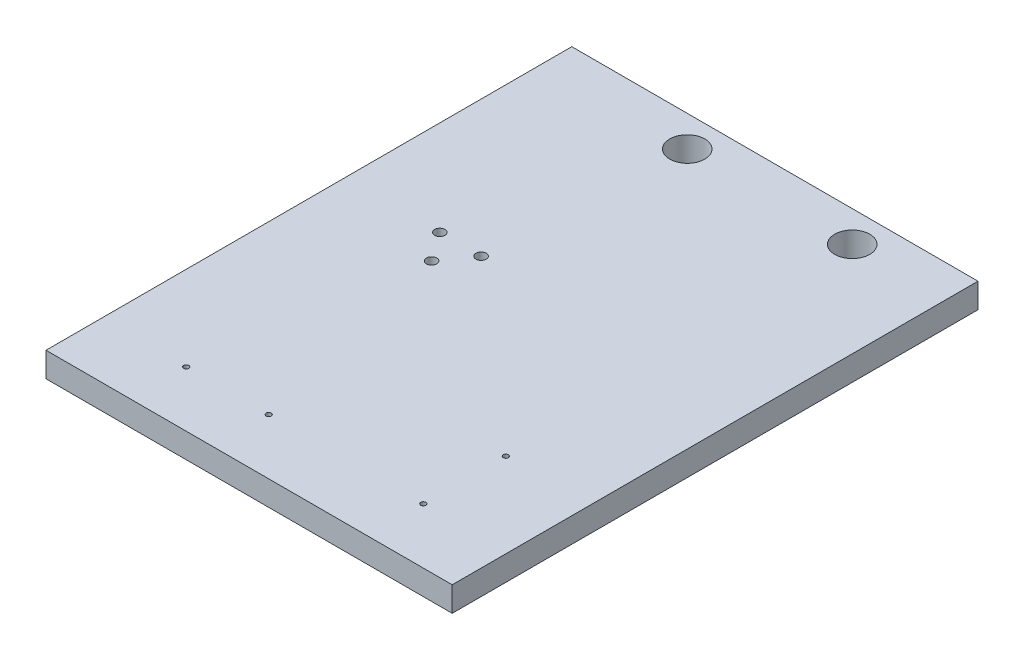
ISO-10303-21;
HEADER;
FILE_DESCRIPTION(('STEP AP214'),'2;1');
FILE_NAME('part.step','',(''),(''),'','','');
FILE_SCHEMA(('AUTOMOTIVE_DESIGN { 1 0 10303 214 1 1 1 1 }'));
ENDSEC;
DATA;
#1=APPLICATION_CONTEXT('core data for automotive mechanical design processes');
#2=APPLICATION_PROTOCOL_DEFINITION('international standard','automotive_design',2000,#1);
#3=PRODUCT_CONTEXT('',#1,'mechanical');
#4=PRODUCT('Part','Part','',(#3));
#5=PRODUCT_RELATED_PRODUCT_CATEGORY('part','',(#4));
#6=PRODUCT_DEFINITION_FORMATION('','',#4);
#7=PRODUCT_DEFINITION_CONTEXT('part definition',#1,'design');
#8=PRODUCT_DEFINITION('design','',#6,#7);
#9=PRODUCT_DEFINITION_SHAPE('','',#8);
#10=(LENGTH_UNIT() NAMED_UNIT(*) SI_UNIT(.MILLI.,.METRE.));
#11=(NAMED_UNIT(*) PLANE_ANGLE_UNIT() SI_UNIT($,.RADIAN.));
#12=(NAMED_UNIT(*) SI_UNIT($,.STERADIAN.) SOLID_ANGLE_UNIT());
#13=UNCERTAINTY_MEASURE_WITH_UNIT(LENGTH_MEASURE(1.E-05),#10,'distance_accuracy_value','');
#14=(GEOMETRIC_REPRESENTATION_CONTEXT(3) GLOBAL_UNCERTAINTY_ASSIGNED_CONTEXT((#13)) GLOBAL_UNIT_ASSIGNED_CONTEXT((#10,
#11,#12)) REPRESENTATION_CONTEXT('',''));
#15=CARTESIAN_POINT('',(0.,0.,0.));
#16=DIRECTION('',(0.,0.,1.));
#17=DIRECTION('',(1.,0.,0.));
#18=AXIS2_PLACEMENT_3D('',#15,#16,#17);
#19=CARTESIAN_POINT('',(57.5,5.99999999997181,100.5));
#20=DIRECTION('',(0.,1.,0.));
#21=DIRECTION('',(0.,0.,1.));
#22=AXIS2_PLACEMENT_3D('',#19,#20,#21);
#23=CONICAL_SURFACE('',#22,1.24999999995953,1.0297442586752);
#24=CARTESIAN_POINT('',(57.5,6.00000000000001,100.5));
#25=DIRECTION('',(0.,1.,0.));
#26=DIRECTION('',(0.,0.,1.));
#27=AXIS2_PLACEMENT_3D('',#24,#25,#26);
#28=CIRCLE('',#27,1.25);
#29=CARTESIAN_POINT('',(56.2500000000085,6.00000000000717,100.5));
#30=VERTEX_POINT('',#29);
#31=CARTESIAN_POINT('',(58.7499999999937,6.00000000000717,100.5));
#32=VERTEX_POINT('',#31);
#33=EDGE_CURVE('E127',#30,#32,#28,.T.);
#34=ORIENTED_EDGE('',*,*,#33,.T.);
#35=DIRECTION('',(-0.857167300703835,-0.515038074907187,0.));
#36=VECTOR('',#35,1.);
#37=CARTESIAN_POINT('',(498957.,299774.311324496,100.500000000031));
#38=LINE('',#37,#36);
#39=CARTESIAN_POINT('',(57.4999999999761,5.24892422626522,100.5));
#40=VERTEX_POINT('',#39);
#41=EDGE_CURVE('E120',#32,#40,#38,.T.);
#42=ORIENTED_EDGE('',*,*,#41,.T.);
#43=DIRECTION('',(0.857167300703835,-0.515038074907187,0.));
#44=VECTOR('',#43,1.);
#45=CARTESIAN_POINT('',(-498842.,299774.311324496,100.499999999908));
#46=LINE('',#45,#44);
#47=EDGE_CURVE('E117',#40,#30,#46,.F.);
#48=ORIENTED_EDGE('',*,*,#47,.T.);
#49=EDGE_LOOP('',(#34,#42,#48));
#50=FACE_BOUND('',#49,.T.);
#51=ADVANCED_FACE('F24',(#50),#23,.F.);
#52=CARTESIAN_POINT('',(57.5,6.00000000002865,100.5));
#53=DIRECTION('',(0.,1.,0.));
#54=DIRECTION('',(0.,0.,1.));
#55=AXIS2_PLACEMENT_3D('',#52,#53,#54);
#56=CONICAL_SURFACE('',#55,1.24999999998135,1.02974425866186);
#57=ORIENTED_EDGE('',*,*,#47,.F.);
#58=ORIENTED_EDGE('',*,*,#41,.F.);
#59=CARTESIAN_POINT('',(57.5,6.00000000000001,100.5));
#60=DIRECTION('',(0.,1.,0.));
#61=DIRECTION('',(0.,0.,1.));
#62=AXIS2_PLACEMENT_3D('',#59,#60,#61);
#63=CIRCLE('',#62,1.25);
#64=EDGE_CURVE('E123',#32,#30,#63,.T.);
#65=ORIENTED_EDGE('',*,*,#64,.T.);
#66=EDGE_LOOP('',(#57,#58,#65));
#67=FACE_BOUND('',#66,.T.);
#68=ADVANCED_FACE('F119',(#67),#56,.F.);
#69=CARTESIAN_POINT('',(-17.5,5.99999999997181,100.5));
#70=DIRECTION('',(0.,1.,0.));
#71=DIRECTION('',(0.,0.,1.));
#72=AXIS2_PLACEMENT_3D('',#69,#70,#71);
#73=CONICAL_SURFACE('',#72,1.24999999995953,1.0297442586752);
#74=CARTESIAN_POINT('',(-17.5,6.00000000000001,100.5));
#75=DIRECTION('',(0.,1.,0.));
#76=DIRECTION('',(0.,0.,1.));
#77=AXIS2_PLACEMENT_3D('',#74,#75,#76);
#78=CIRCLE('',#77,1.25);
#79=CARTESIAN_POINT('',(-18.7499999999887,6.00000000000717,100.5));
#80=VERTEX_POINT('',#79);
#81=CARTESIAN_POINT('',(-16.2500000000035,6.00000000000717,100.5));
#82=VERTEX_POINT('',#81);
#83=EDGE_CURVE('E254',#80,#82,#78,.T.);
#84=ORIENTED_EDGE('',*,*,#83,.T.);
#85=DIRECTION('',(-0.857167300703835,-0.515038074907187,0.));
#86=VECTOR('',#85,1.);
#87=CARTESIAN_POINT('',(498882.,299774.311324496,100.500000000031));
#88=LINE('',#87,#86);
#89=CARTESIAN_POINT('',(-17.5000000000125,5.24892422626522,100.5));
#90=VERTEX_POINT('',#89);
#91=EDGE_CURVE('E125',#82,#90,#88,.T.);
#92=ORIENTED_EDGE('',*,*,#91,.T.);
#93=DIRECTION('',(0.857167300703835,-0.515038074907187,0.));
#94=VECTOR('',#93,1.);
#95=CARTESIAN_POINT('',(-498917.,299774.311324496,100.499999999908));
#96=LINE('',#95,#94);
#97=EDGE_CURVE('E251',#90,#80,#96,.F.);
#98=ORIENTED_EDGE('',*,*,#97,.T.);
#99=EDGE_LOOP('',(#84,#92,#98));
#100=FACE_BOUND('',#99,.T.);
#101=ADVANCED_FACE('F277',(#100),#73,.F.);
#102=CARTESIAN_POINT('',(-17.5,6.00000000002865,100.5));
#103=DIRECTION('',(0.,1.,0.));
#104=DIRECTION('',(0.,0.,1.));
#105=AXIS2_PLACEMENT_3D('',#102,#103,#104);
#106=CONICAL_SURFACE('',#105,1.24999999998135,1.02974425866186);
#107=ORIENTED_EDGE('',*,*,#97,.F.);
#108=ORIENTED_EDGE('',*,*,#91,.F.);
#109=CARTESIAN_POINT('',(-17.5,6.00000000000001,100.5));
#110=DIRECTION('',(0.,1.,0.));
#111=DIRECTION('',(0.,0.,1.));
#112=AXIS2_PLACEMENT_3D('',#109,#110,#111);
#113=CIRCLE('',#112,1.25);
#114=EDGE_CURVE('E237',#82,#80,#113,.T.);
#115=ORIENTED_EDGE('',*,*,#114,.T.);
#116=EDGE_LOOP('',(#107,#108,#115));
#117=FACE_BOUND('',#116,.T.);
#118=ADVANCED_FACE('F280',(#117),#106,.F.);
#119=CARTESIAN_POINT('',(57.4999999999998,5.99999999991496,60.5));
#120=DIRECTION('',(0.,1.,0.));
#121=DIRECTION('',(-1.,0.,0.));
#122=AXIS2_PLACEMENT_3D('',#119,#120,#121);
#123=CONICAL_SURFACE('',#122,1.24999999975262,1.02974425843444);
#124=CARTESIAN_POINT('',(57.4999999999998,6.00000000000001,60.5));
#125=DIRECTION('',(0.,1.,0.));
#126=DIRECTION('',(0.,0.,1.));
#127=AXIS2_PLACEMENT_3D('',#124,#125,#126);
#128=CIRCLE('',#127,1.25);
#129=CARTESIAN_POINT('',(56.250000000051,5.99999999997874,60.5));
#130=VERTEX_POINT('',#129);
#131=CARTESIAN_POINT('',(58.7499999999225,5.99999999996453,60.5));
#132=VERTEX_POINT('',#131);
#133=EDGE_CURVE('E234',#130,#132,#128,.T.);
#134=ORIENTED_EDGE('',*,*,#133,.T.);
#135=DIRECTION('',(-0.857167300703836,-0.515038074907186,0.));
#136=VECTOR('',#135,1.);
#137=CARTESIAN_POINT('',(498997.,299798.345749255,60.5000000000306));
#138=LINE('',#137,#136);
#139=CARTESIAN_POINT('',(57.5000000002317,5.24892422615153,60.5));
#140=VERTEX_POINT('',#139);
#141=EDGE_CURVE('E246',#132,#140,#138,.T.);
#142=ORIENTED_EDGE('',*,*,#141,.T.);
#143=DIRECTION('',(0.857167300703836,-0.515038074907186,0.));
#144=VECTOR('',#143,1.);
#145=CARTESIAN_POINT('',(-498882.,299798.345749255,60.4999999999084));
#146=LINE('',#145,#144);
#147=EDGE_CURVE('E231',#140,#130,#146,.F.);
#148=ORIENTED_EDGE('',*,*,#147,.T.);
#149=EDGE_LOOP('',(#134,#142,#148));
#150=FACE_BOUND('',#149,.T.);
#151=ADVANCED_FACE('F422',(#150),#123,.F.);
#152=CARTESIAN_POINT('',(57.4999999999998,5.99999999991496,60.5));
#153=DIRECTION('',(0.,1.,0.));
#154=DIRECTION('',(-1.,0.,0.));
#155=AXIS2_PLACEMENT_3D('',#152,#153,#154);
#156=CONICAL_SURFACE('',#155,1.24999999979036,1.02974425838754);
#157=ORIENTED_EDGE('',*,*,#147,.F.);
#158=ORIENTED_EDGE('',*,*,#141,.F.);
#159=CARTESIAN_POINT('',(57.4999999999998,6.00000000000001,60.5));
#160=DIRECTION('',(0.,1.,0.));
#161=DIRECTION('',(0.,0.,1.));
#162=AXIS2_PLACEMENT_3D('',#159,#160,#161);
#163=CIRCLE('',#162,1.25);
#164=EDGE_CURVE('E217',#132,#130,#163,.T.);
#165=ORIENTED_EDGE('',*,*,#164,.T.);
#166=EDGE_LOOP('',(#157,#158,#165));
#167=FACE_BOUND('',#166,.T.);
#168=ADVANCED_FACE('F418',(#167),#156,.F.);
#169=CARTESIAN_POINT('',(-57.5,5.99999999997181,100.5));
#170=DIRECTION('',(0.,1.,0.));
#171=DIRECTION('',(0.,0.,1.));
#172=AXIS2_PLACEMENT_3D('',#169,#170,#171);
#173=CONICAL_SURFACE('',#172,1.24999999995953,1.0297442586752);
#174=CARTESIAN_POINT('',(-57.5,6.00000000000001,100.5));
#175=DIRECTION('',(0.,1.,0.));
#176=DIRECTION('',(0.,0.,1.));
#177=AXIS2_PLACEMENT_3D('',#174,#175,#176);
#178=CIRCLE('',#177,1.25);
#179=CARTESIAN_POINT('',(-58.7499999999937,6.00000000000717,100.5));
#180=VERTEX_POINT('',#179);
#181=CARTESIAN_POINT('',(-56.2500000000085,6.00000000000717,100.5));
#182=VERTEX_POINT('',#181);
#183=EDGE_CURVE('E214',#180,#182,#178,.T.);
#184=ORIENTED_EDGE('',*,*,#183,.T.);
#185=DIRECTION('',(-0.857167300703835,-0.515038074907187,0.));
#186=VECTOR('',#185,1.);
#187=CARTESIAN_POINT('',(498842.,299774.311324496,100.50000000003));
#188=LINE('',#187,#186);
#189=CARTESIAN_POINT('',(-57.5000000000329,5.24892422626522,100.5));
#190=VERTEX_POINT('',#189);
#191=EDGE_CURVE('E226',#182,#190,#188,.T.);
#192=ORIENTED_EDGE('',*,*,#191,.T.);
#193=DIRECTION('',(0.857167300703835,-0.515038074907187,0.));
#194=VECTOR('',#193,1.);
#195=CARTESIAN_POINT('',(-498957.,299774.311324496,100.499999999908));
#196=LINE('',#195,#194);
#197=EDGE_CURVE('E211',#190,#180,#196,.F.);
#198=ORIENTED_EDGE('',*,*,#197,.T.);
#199=EDGE_LOOP('',(#184,#192,#198));
#200=FACE_BOUND('',#199,.T.);
#201=ADVANCED_FACE('F414',(#200),#173,.F.);
#202=CARTESIAN_POINT('',(-57.5,6.00000000002865,100.5));
#203=DIRECTION('',(0.,1.,0.));
#204=DIRECTION('',(0.,0.,1.));
#205=AXIS2_PLACEMENT_3D('',#202,#203,#204);
#206=CONICAL_SURFACE('',#205,1.24999999998135,1.02974425866186);
#207=ORIENTED_EDGE('',*,*,#197,.F.);
#208=ORIENTED_EDGE('',*,*,#191,.F.);
#209=CARTESIAN_POINT('',(-57.5,6.00000000000001,100.5));
#210=DIRECTION('',(0.,1.,0.));
#211=DIRECTION('',(0.,0.,1.));
#212=AXIS2_PLACEMENT_3D('',#209,#210,#211);
#213=CIRCLE('',#212,1.25);
#214=EDGE_CURVE('E197',#182,#180,#213,.T.);
#215=ORIENTED_EDGE('',*,*,#214,.T.);
#216=EDGE_LOOP('',(#207,#208,#215));
#217=FACE_BOUND('',#216,.T.);
#218=ADVANCED_FACE('F410',(#217),#206,.F.);
#219=CARTESIAN_POINT('',(-32.5,7.00000000006185,-17.5));
#220=DIRECTION('',(0.,1.,0.));
#221=DIRECTION('',(0.,0.,1.));
#222=AXIS2_PLACEMENT_3D('',#219,#220,#221);
#223=CONICAL_SURFACE('',#222,2.5000000000955,1.02974425867857);
#224=CARTESIAN_POINT('',(-32.5,7.00000000000001,-17.5));
#225=DIRECTION('',(0.,1.,0.));
#226=DIRECTION('',(0.,0.,1.));
#227=AXIS2_PLACEMENT_3D('',#224,#225,#226);
#228=CIRCLE('',#227,2.5);
#229=CARTESIAN_POINT('',(-35.0000000000062,7.00000000001544,-17.5));
#230=VERTEX_POINT('',#229);
#231=CARTESIAN_POINT('',(-29.9999999999932,7.00000000001544,-17.5));
#232=VERTEX_POINT('',#231);
#233=EDGE_CURVE('E194',#230,#232,#228,.T.);
#234=ORIENTED_EDGE('',*,*,#233,.T.);
#235=DIRECTION('',(-0.857167300703835,-0.515038074907187,0.));
#236=VECTOR('',#235,1.);
#237=CARTESIAN_POINT('',(498985.,299845.461801766,-17.4999999999695));
#238=LINE('',#237,#236);
#239=CARTESIAN_POINT('',(-32.5000000000557,5.49784845250656,-17.5));
#240=VERTEX_POINT('',#239);
#241=EDGE_CURVE('E206',#232,#240,#238,.T.);
#242=ORIENTED_EDGE('',*,*,#241,.T.);
#243=DIRECTION('',(0.857167300703835,-0.515038074907187,0.));
#244=VECTOR('',#243,1.);
#245=CARTESIAN_POINT('',(-499050.,299845.461801766,-17.5000000000917));
#246=LINE('',#245,#244);
#247=EDGE_CURVE('E191',#240,#230,#246,.F.);
#248=ORIENTED_EDGE('',*,*,#247,.T.);
#249=EDGE_LOOP('',(#234,#242,#248));
#250=FACE_BOUND('',#249,.T.);
#251=ADVANCED_FACE('F406',(#250),#223,.F.);
#252=CARTESIAN_POINT('',(-32.5,7.00000000017553,-17.5));
#253=DIRECTION('',(0.,1.,0.));
#254=DIRECTION('',(0.,0.,1.));
#255=AXIS2_PLACEMENT_3D('',#252,#253,#254);
#256=CONICAL_SURFACE('',#255,2.50000000018417,1.02974425866419);
#257=ORIENTED_EDGE('',*,*,#247,.F.);
#258=ORIENTED_EDGE('',*,*,#241,.F.);
#259=CARTESIAN_POINT('',(-32.5,7.00000000000001,-17.5));
#260=DIRECTION('',(0.,1.,0.));
#261=DIRECTION('',(0.,0.,1.));
#262=AXIS2_PLACEMENT_3D('',#259,#260,#261);
#263=CIRCLE('',#262,2.5);
#264=EDGE_CURVE('E176',#232,#230,#263,.T.);
#265=ORIENTED_EDGE('',*,*,#264,.T.);
#266=EDGE_LOOP('',(#257,#258,#265));
#267=FACE_BOUND('',#266,.T.);
#268=ADVANCED_FACE('F402',(#267),#256,.F.);
#269=CARTESIAN_POINT('',(-52.5,7.00000000006185,-17.5));
#270=DIRECTION('',(0.,1.,0.));
#271=DIRECTION('',(0.,0.,1.));
#272=AXIS2_PLACEMENT_3D('',#269,#270,#271);
#273=CONICAL_SURFACE('',#272,2.5000000000955,1.02974425867857);
#274=CARTESIAN_POINT('',(-52.5,7.00000000000001,-17.5));
#275=DIRECTION('',(0.,1.,0.));
#276=DIRECTION('',(0.,0.,1.));
#277=AXIS2_PLACEMENT_3D('',#274,#275,#276);
#278=CIRCLE('',#277,2.5);
#279=CARTESIAN_POINT('',(-55.0000000000017,7.00000000001544,-17.5));
#280=VERTEX_POINT('',#279);
#281=CARTESIAN_POINT('',(-50.0000000000028,7.00000000001544,-17.5));
#282=VERTEX_POINT('',#281);
#283=EDGE_CURVE('E171',#280,#282,#278,.T.);
#284=ORIENTED_EDGE('',*,*,#283,.T.);
#285=DIRECTION('',(-0.857167300703835,-0.515038074907187,0.));
#286=VECTOR('',#285,1.);
#287=CARTESIAN_POINT('',(498965.,299845.461801766,-17.4999999999694));
#288=LINE('',#287,#286);
#289=CARTESIAN_POINT('',(-52.5000000000659,5.49784845250656,-17.5));
#290=VERTEX_POINT('',#289);
#291=EDGE_CURVE('E186',#282,#290,#288,.T.);
#292=ORIENTED_EDGE('',*,*,#291,.T.);
#293=DIRECTION('',(0.857167300703835,-0.515038074907187,0.));
#294=VECTOR('',#293,1.);
#295=CARTESIAN_POINT('',(-499070.,299845.461801766,-17.5000000000917));
#296=LINE('',#295,#294);
#297=EDGE_CURVE('E183',#290,#280,#296,.F.);
#298=ORIENTED_EDGE('',*,*,#297,.T.);
#299=EDGE_LOOP('',(#284,#292,#298));
#300=FACE_BOUND('',#299,.T.);
#301=ADVANCED_FACE('F399',(#300),#273,.F.);
#302=CARTESIAN_POINT('',(-52.5,7.00000000006185,-17.5));
#303=DIRECTION('',(0.,1.,0.));
#304=DIRECTION('',(0.,0.,1.));
#305=AXIS2_PLACEMENT_3D('',#302,#303,#304);
#306=CONICAL_SURFACE('',#305,2.50000000001364,1.02974425866749);
#307=ORIENTED_EDGE('',*,*,#297,.F.);
#308=ORIENTED_EDGE('',*,*,#291,.F.);
#309=CARTESIAN_POINT('',(-52.5,7.00000000000001,-17.5));
#310=DIRECTION('',(0.,1.,0.));
#311=DIRECTION('',(0.,0.,1.));
#312=AXIS2_PLACEMENT_3D('',#309,#310,#311);
#313=CIRCLE('',#312,2.5);
#314=EDGE_CURVE('E167',#282,#280,#313,.T.);
#315=ORIENTED_EDGE('',*,*,#314,.T.);
#316=EDGE_LOOP('',(#307,#308,#315));
#317=FACE_BOUND('',#316,.T.);
#318=ADVANCED_FACE('F396',(#317),#306,.F.);
#319=CARTESIAN_POINT('',(-42.5,7.00000000000001,-3.5));
#320=DIRECTION('',(0.,-1.,0.));
#321=DIRECTION('',(0.,0.,-1.));
#322=AXIS2_PLACEMENT_3D('',#319,#320,#321);
#323=PLANE('',#322);
#324=CARTESIAN_POINT('',(-42.5,7.00000000000001,-3.5));
#325=DIRECTION('',(0.,-1.,0.));
#326=DIRECTION('',(0.,0.,-1.));
#327=AXIS2_PLACEMENT_3D('',#324,#325,#326);
#328=CIRCLE('',#327,2.5);
#329=CARTESIAN_POINT('',(-42.5,7.00000000000001,-6.));
#330=VERTEX_POINT('',#329);
#331=EDGE_CURVE('E27',#330,#330,#328,.F.);
#332=ORIENTED_EDGE('',*,*,#331,.T.);
#333=EDGE_LOOP('',(#332));
#334=FACE_BOUND('',#333,.T.);
#335=ADVANCED_FACE('F392',(#334),#323,.F.);
#336=CARTESIAN_POINT('',(57.5,4.91137043752998,100.5));
#337=DIRECTION('',(0.,1.,0.));
#338=DIRECTION('',(0.,0.,1.));
#339=AXIS2_PLACEMENT_3D('',#336,#337,#338);
#340=CYLINDRICAL_SURFACE('',#339,1.25);
#341=ORIENTED_EDGE('',*,*,#64,.F.);
#342=ORIENTED_EDGE('',*,*,#33,.F.);
#343=EDGE_LOOP('',(#341,#342));
#344=FACE_BOUND('',#343,.T.);
#345=CARTESIAN_POINT('',(57.5,12.,100.5));
#346=DIRECTION('',(0.,1.,0.));
#347=DIRECTION('',(0.,0.,1.));
#348=AXIS2_PLACEMENT_3D('',#345,#346,#347);
#349=CIRCLE('',#348,1.25);
#350=CARTESIAN_POINT('',(57.5,12.,101.75));
#351=VERTEX_POINT('',#350);
#352=EDGE_CURVE('E162',#351,#351,#349,.F.);
#353=ORIENTED_EDGE('',*,*,#352,.F.);
#354=EDGE_LOOP('',(#353));
#355=FACE_BOUND('',#354,.T.);
#356=ADVANCED_FACE('F286',(#344,#355),#340,.F.);
#357=CARTESIAN_POINT('',(-17.5,4.91137043752998,100.5));
#358=DIRECTION('',(0.,1.,0.));
#359=DIRECTION('',(0.,0.,1.));
#360=AXIS2_PLACEMENT_3D('',#357,#358,#359);
#361=CYLINDRICAL_SURFACE('',#360,1.25);
#362=ORIENTED_EDGE('',*,*,#114,.F.);
#363=ORIENTED_EDGE('',*,*,#83,.F.);
#364=EDGE_LOOP('',(#362,#363));
#365=FACE_BOUND('',#364,.T.);
#366=CARTESIAN_POINT('',(-17.5,12.,100.5));
#367=DIRECTION('',(0.,1.,0.));
#368=DIRECTION('',(0.,0.,1.));
#369=AXIS2_PLACEMENT_3D('',#366,#367,#368);
#370=CIRCLE('',#369,1.25);
#371=CARTESIAN_POINT('',(-17.5,12.,101.75));
#372=VERTEX_POINT('',#371);
#373=EDGE_CURVE('E160',#372,#372,#370,.F.);
#374=ORIENTED_EDGE('',*,*,#373,.F.);
#375=EDGE_LOOP('',(#374));
#376=FACE_BOUND('',#375,.T.);
#377=ADVANCED_FACE('F282',(#365,#376),#361,.F.);
#378=CARTESIAN_POINT('',(57.4999999999998,4.91137043752998,60.5));
#379=DIRECTION('',(0.,1.,0.));
#380=DIRECTION('',(0.,0.,1.));
#381=AXIS2_PLACEMENT_3D('',#378,#379,#380);
#382=CYLINDRICAL_SURFACE('',#381,1.25);
#383=ORIENTED_EDGE('',*,*,#164,.F.);
#384=ORIENTED_EDGE('',*,*,#133,.F.);
#385=EDGE_LOOP('',(#383,#384));
#386=FACE_BOUND('',#385,.T.);
#387=CARTESIAN_POINT('',(57.4999999999998,12.,60.5));
#388=DIRECTION('',(0.,1.,0.));
#389=DIRECTION('',(0.,0.,1.));
#390=AXIS2_PLACEMENT_3D('',#387,#388,#389);
#391=CIRCLE('',#390,1.25);
#392=CARTESIAN_POINT('',(57.4999999999998,12.,61.75));
#393=VERTEX_POINT('',#392);
#394=EDGE_CURVE('E157',#393,#393,#391,.F.);
#395=ORIENTED_EDGE('',*,*,#394,.F.);
#396=EDGE_LOOP('',(#395));
#397=FACE_BOUND('',#396,.T.);
#398=ADVANCED_FACE('F285',(#386,#397),#382,.F.);
#399=CARTESIAN_POINT('',(-57.5,4.91137043752998,100.5));
#400=DIRECTION('',(0.,1.,0.));
#401=DIRECTION('',(0.,0.,1.));
#402=AXIS2_PLACEMENT_3D('',#399,#400,#401);
#403=CYLINDRICAL_SURFACE('',#402,1.25);
#404=ORIENTED_EDGE('',*,*,#214,.F.);
#405=ORIENTED_EDGE('',*,*,#183,.F.);
#406=EDGE_LOOP('',(#404,#405));
#407=FACE_BOUND('',#406,.T.);
#408=CARTESIAN_POINT('',(-57.5,12.,100.5));
#409=DIRECTION('',(0.,1.,0.));
#410=DIRECTION('',(0.,0.,1.));
#411=AXIS2_PLACEMENT_3D('',#408,#409,#410);
#412=CIRCLE('',#411,1.25);
#413=CARTESIAN_POINT('',(-57.5,12.,101.75));
#414=VERTEX_POINT('',#413);
#415=EDGE_CURVE('E154',#414,#414,#412,.F.);
#416=ORIENTED_EDGE('',*,*,#415,.F.);
#417=EDGE_LOOP('',(#416));
#418=FACE_BOUND('',#417,.T.);
#419=ADVANCED_FACE('F378',(#407,#418),#403,.F.);
#420=CARTESIAN_POINT('',(-32.5,4.92274087505001,-17.5));
#421=DIRECTION('',(0.,1.,0.));
#422=DIRECTION('',(0.,0.,1.));
#423=AXIS2_PLACEMENT_3D('',#420,#421,#422);
#424=CYLINDRICAL_SURFACE('',#423,2.5);
#425=ORIENTED_EDGE('',*,*,#264,.F.);
#426=ORIENTED_EDGE('',*,*,#233,.F.);
#427=EDGE_LOOP('',(#425,#426));
#428=FACE_BOUND('',#427,.T.);
#429=CARTESIAN_POINT('',(-32.5,12.,-17.5));
#430=DIRECTION('',(0.,1.,0.));
#431=DIRECTION('',(0.,0.,1.));
#432=AXIS2_PLACEMENT_3D('',#429,#430,#431);
#433=CIRCLE('',#432,2.5);
#434=CARTESIAN_POINT('',(-32.5,12.,-15.));
#435=VERTEX_POINT('',#434);
#436=EDGE_CURVE('E151',#435,#435,#433,.F.);
#437=ORIENTED_EDGE('',*,*,#436,.F.);
#438=EDGE_LOOP('',(#437));
#439=FACE_BOUND('',#438,.T.);
#440=ADVANCED_FACE('F384',(#428,#439),#424,.F.);
#441=CARTESIAN_POINT('',(-52.5,4.92274087505001,-17.5));
#442=DIRECTION('',(0.,1.,0.));
#443=DIRECTION('',(0.,0.,1.));
#444=AXIS2_PLACEMENT_3D('',#441,#442,#443);
#445=CYLINDRICAL_SURFACE('',#444,2.5);
#446=ORIENTED_EDGE('',*,*,#314,.F.);
#447=ORIENTED_EDGE('',*,*,#283,.F.);
#448=EDGE_LOOP('',(#446,#447));
#449=FACE_BOUND('',#448,.T.);
#450=CARTESIAN_POINT('',(-52.5,12.,-17.5));
#451=DIRECTION('',(0.,1.,0.));
#452=DIRECTION('',(0.,0.,1.));
#453=AXIS2_PLACEMENT_3D('',#450,#451,#452);
#454=CIRCLE('',#453,2.5);
#455=CARTESIAN_POINT('',(-52.5,12.,-15.));
#456=VERTEX_POINT('',#455);
#457=EDGE_CURVE('E148',#456,#456,#454,.F.);
#458=ORIENTED_EDGE('',*,*,#457,.F.);
#459=EDGE_LOOP('',(#458));
#460=FACE_BOUND('',#459,.T.);
#461=ADVANCED_FACE('F512',(#449,#460),#445,.F.);
#462=CARTESIAN_POINT('',(-42.5,27.,-3.5));
#463=DIRECTION('',(0.,-1.,0.));
#464=DIRECTION('',(0.,0.,-1.));
#465=AXIS2_PLACEMENT_3D('',#462,#463,#464);
#466=CYLINDRICAL_SURFACE('',#465,2.5);
#467=ORIENTED_EDGE('',*,*,#331,.F.);
#468=EDGE_LOOP('',(#467));
#469=FACE_BOUND('',#468,.T.);
#470=CARTESIAN_POINT('',(-42.5,12.,-3.5));
#471=DIRECTION('',(0.,-1.,0.));
#472=DIRECTION('',(0.,0.,-1.));
#473=AXIS2_PLACEMENT_3D('',#470,#471,#472);
#474=CIRCLE('',#473,2.5);
#475=CARTESIAN_POINT('',(-42.5,12.,-6.));
#476=VERTEX_POINT('',#475);
#477=EDGE_CURVE('E144',#476,#476,#474,.T.);
#478=ORIENTED_EDGE('',*,*,#477,.F.);
#479=EDGE_LOOP('',(#478));
#480=FACE_BOUND('',#479,.T.);
#481=ADVANCED_FACE('F293',(#469,#480),#466,.F.);
#482=CARTESIAN_POINT('',(0.,12.,0.));
#483=DIRECTION('',(0.,1.,0.));
#484=DIRECTION('',(0.,0.,1.));
#485=AXIS2_PLACEMENT_3D('',#482,#483,#484);
#486=PLANE('',#485);
#487=ORIENTED_EDGE('',*,*,#477,.T.);
#488=EDGE_LOOP('',(#487));
#489=FACE_BOUND('',#488,.T.);
#490=CARTESIAN_POINT('',(52.4999999999998,12.,-112.5));
#491=DIRECTION('',(0.,1.,0.));
#492=DIRECTION('',(0.,0.,1.));
#493=AXIS2_PLACEMENT_3D('',#490,#491,#492);
#494=CIRCLE('',#493,8.5);
#495=CARTESIAN_POINT('',(52.4999999999998,12.,-104.));
#496=VERTEX_POINT('',#495);
#497=EDGE_CURVE('E137',#496,#496,#494,.F.);
#498=ORIENTED_EDGE('',*,*,#497,.T.);
#499=EDGE_LOOP('',(#498));
#500=FACE_BOUND('',#499,.T.);
#501=CARTESIAN_POINT('',(-27.5,12.,-112.5));
#502=DIRECTION('',(0.,-1.,0.));
#503=DIRECTION('',(0.,0.,-1.));
#504=AXIS2_PLACEMENT_3D('',#501,#502,#503);
#505=CIRCLE('',#504,8.5);
#506=CARTESIAN_POINT('',(-27.5,12.,-121.));
#507=VERTEX_POINT('',#506);
#508=EDGE_CURVE('E141',#507,#507,#505,.T.);
#509=ORIENTED_EDGE('',*,*,#508,.T.);
#510=EDGE_LOOP('',(#509));
#511=FACE_BOUND('',#510,.T.);
#512=ORIENTED_EDGE('',*,*,#457,.T.);
#513=EDGE_LOOP('',(#512));
#514=FACE_BOUND('',#513,.T.);
#515=ORIENTED_EDGE('',*,*,#436,.T.);
#516=EDGE_LOOP('',(#515));
#517=FACE_BOUND('',#516,.T.);
#518=ORIENTED_EDGE('',*,*,#415,.T.);
#519=EDGE_LOOP('',(#518));
#520=FACE_BOUND('',#519,.T.);
#521=ORIENTED_EDGE('',*,*,#394,.T.);
#522=EDGE_LOOP('',(#521));
#523=FACE_BOUND('',#522,.T.);
#524=ORIENTED_EDGE('',*,*,#373,.T.);
#525=EDGE_LOOP('',(#524));
#526=FACE_BOUND('',#525,.T.);
#527=ORIENTED_EDGE('',*,*,#352,.T.);
#528=EDGE_LOOP('',(#527));
#529=FACE_BOUND('',#528,.T.);
#530=DIRECTION('',(-1.,0.,0.));
#531=VECTOR('',#530,1.);
#532=CARTESIAN_POINT('',(98.4999999999996,12.,-127.5));
#533=LINE('',#532,#531);
#534=CARTESIAN_POINT('',(-98.5000000000001,12.,-127.5));
#535=VERTEX_POINT('',#534);
#536=CARTESIAN_POINT('',(98.4999999999996,12.,-127.5));
#537=VERTEX_POINT('',#536);
#538=EDGE_CURVE('E300',#535,#537,#533,.F.);
#539=ORIENTED_EDGE('',*,*,#538,.F.);
#540=DIRECTION('',(0.,0.,1.));
#541=VECTOR('',#540,1.);
#542=CARTESIAN_POINT('',(-98.5000000000001,12.,-127.5));
#543=LINE('',#542,#541);
#544=CARTESIAN_POINT('',(-98.5,12.,127.5));
#545=VERTEX_POINT('',#544);
#546=EDGE_CURVE('E147',#545,#535,#543,.F.);
#547=ORIENTED_EDGE('',*,*,#546,.F.);
#548=DIRECTION('',(1.,0.,0.));
#549=VECTOR('',#548,1.);
#550=CARTESIAN_POINT('',(-98.5,12.,127.5));
#551=LINE('',#550,#549);
#552=CARTESIAN_POINT('',(98.5,12.,127.5));
#553=VERTEX_POINT('',#552);
#554=EDGE_CURVE('E316',#553,#545,#551,.F.);
#555=ORIENTED_EDGE('',*,*,#554,.F.);
#556=DIRECTION('',(0.,0.,-1.));
#557=VECTOR('',#556,1.);
#558=CARTESIAN_POINT('',(98.5,12.,127.5));
#559=LINE('',#558,#557);
#560=EDGE_CURVE('E303',#537,#553,#559,.F.);
#561=ORIENTED_EDGE('',*,*,#560,.F.);
#562=EDGE_LOOP('',(#539,#547,#555,#561));
#563=FACE_BOUND('',#562,.T.);
#564=ADVANCED_FACE('F290',(#489,#500,#511,#514,#517,#520,#523,#526,#529,#563),#486,.T.);
#565=CARTESIAN_POINT('',(-98.5000000000001,0.,-127.5));
#566=DIRECTION('',(-1.,0.,0.));
#567=DIRECTION('',(0.,0.,1.));
#568=AXIS2_PLACEMENT_3D('',#565,#566,#567);
#569=PLANE('',#568);
#570=DIRECTION('',(0.,1.,0.));
#571=VECTOR('',#570,1.);
#572=CARTESIAN_POINT('',(-98.5000000000001,0.,-127.5));
#573=LINE('',#572,#571);
#574=CARTESIAN_POINT('',(-98.5000000000001,0.,-127.5));
#575=VERTEX_POINT('',#574);
#576=EDGE_CURVE('E305',#575,#535,#573,.T.);
#577=ORIENTED_EDGE('',*,*,#576,.F.);
#578=DIRECTION('',(0.,0.,1.));
#579=VECTOR('',#578,1.);
#580=CARTESIAN_POINT('',(-98.5,0.,0.));
#581=LINE('',#580,#579);
#582=CARTESIAN_POINT('',(-98.5,0.,127.5));
#583=VERTEX_POINT('',#582);
#584=EDGE_CURVE('E140',#575,#583,#581,.T.);
#585=ORIENTED_EDGE('',*,*,#584,.T.);
#586=DIRECTION('',(0.,1.,0.));
#587=VECTOR('',#586,1.);
#588=CARTESIAN_POINT('',(-98.5,0.,127.5));
#589=LINE('',#588,#587);
#590=EDGE_CURVE('E314',#545,#583,#589,.F.);
#591=ORIENTED_EDGE('',*,*,#590,.F.);
#592=ORIENTED_EDGE('',*,*,#546,.T.);
#593=EDGE_LOOP('',(#577,#585,#591,#592));
#594=FACE_BOUND('',#593,.T.);
#595=ADVANCED_FACE('F292',(#594),#569,.T.);
#596=CARTESIAN_POINT('',(-98.5,0.,127.5));
#597=DIRECTION('',(0.,0.,1.));
#598=DIRECTION('',(1.,0.,0.));
#599=AXIS2_PLACEMENT_3D('',#596,#597,#598);
#600=PLANE('',#599);
#601=ORIENTED_EDGE('',*,*,#590,.T.);
#602=DIRECTION('',(1.,0.,0.));
#603=VECTOR('',#602,1.);
#604=CARTESIAN_POINT('',(0.,0.,127.5));
#605=LINE('',#604,#603);
#606=CARTESIAN_POINT('',(98.5,0.,127.5));
#607=VERTEX_POINT('',#606);
#608=EDGE_CURVE('E327',#583,#607,#605,.T.);
#609=ORIENTED_EDGE('',*,*,#608,.T.);
#610=DIRECTION('',(0.,1.,0.));
#611=VECTOR('',#610,1.);
#612=CARTESIAN_POINT('',(98.5,0.,127.5));
#613=LINE('',#612,#611);
#614=EDGE_CURVE('E308',#553,#607,#613,.F.);
#615=ORIENTED_EDGE('',*,*,#614,.F.);
#616=ORIENTED_EDGE('',*,*,#554,.T.);
#617=EDGE_LOOP('',(#601,#609,#615,#616));
#618=FACE_BOUND('',#617,.T.);
#619=ADVANCED_FACE('F335',(#618),#600,.T.);
#620=CARTESIAN_POINT('',(98.5,0.,127.5));
#621=DIRECTION('',(1.,0.,0.));
#622=DIRECTION('',(0.,0.,-1.));
#623=AXIS2_PLACEMENT_3D('',#620,#621,#622);
#624=PLANE('',#623);
#625=ORIENTED_EDGE('',*,*,#614,.T.);
#626=DIRECTION('',(0.,0.,1.));
#627=VECTOR('',#626,1.);
#628=CARTESIAN_POINT('',(98.5,0.,0.));
#629=LINE('',#628,#627);
#630=CARTESIAN_POINT('',(98.4999999999996,0.,-127.5));
#631=VERTEX_POINT('',#630);
#632=EDGE_CURVE('E325',#607,#631,#629,.F.);
#633=ORIENTED_EDGE('',*,*,#632,.T.);
#634=DIRECTION('',(0.,1.,0.));
#635=VECTOR('',#634,1.);
#636=CARTESIAN_POINT('',(98.4999999999996,0.,-127.5));
#637=LINE('',#636,#635);
#638=EDGE_CURVE('E42',#537,#631,#637,.F.);
#639=ORIENTED_EDGE('',*,*,#638,.F.);
#640=ORIENTED_EDGE('',*,*,#560,.T.);
#641=EDGE_LOOP('',(#625,#633,#639,#640));
#642=FACE_BOUND('',#641,.T.);
#643=ADVANCED_FACE('F337',(#642),#624,.T.);
#644=CARTESIAN_POINT('',(98.4999999999996,0.,-127.5));
#645=DIRECTION('',(0.,0.,-1.));
#646=DIRECTION('',(-1.,0.,0.));
#647=AXIS2_PLACEMENT_3D('',#644,#645,#646);
#648=PLANE('',#647);
#649=ORIENTED_EDGE('',*,*,#638,.T.);
#650=DIRECTION('',(1.,0.,0.));
#651=VECTOR('',#650,1.);
#652=CARTESIAN_POINT('',(-3.88578058618805E-13,0.,-127.5));
#653=LINE('',#652,#651);
#654=EDGE_CURVE('E136',#631,#575,#653,.F.);
#655=ORIENTED_EDGE('',*,*,#654,.T.);
#656=ORIENTED_EDGE('',*,*,#576,.T.);
#657=ORIENTED_EDGE('',*,*,#538,.T.);
#658=EDGE_LOOP('',(#649,#655,#656,#657));
#659=FACE_BOUND('',#658,.T.);
#660=ADVANCED_FACE('F321',(#659),#648,.T.);
#661=CARTESIAN_POINT('',(-27.5,12.,-112.5));
#662=DIRECTION('',(0.,-1.,0.));
#663=DIRECTION('',(0.,0.,-1.));
#664=AXIS2_PLACEMENT_3D('',#661,#662,#663);
#665=CYLINDRICAL_SURFACE('',#664,8.5);
#666=ORIENTED_EDGE('',*,*,#508,.F.);
#667=EDGE_LOOP('',(#666));
#668=FACE_BOUND('',#667,.T.);
#669=CARTESIAN_POINT('',(-27.5,0.,-112.5));
#670=DIRECTION('',(0.,-1.,0.));
#671=DIRECTION('',(0.,0.,-1.));
#672=AXIS2_PLACEMENT_3D('',#669,#670,#671);
#673=CIRCLE('',#672,8.5);
#674=CARTESIAN_POINT('',(-27.5,0.,-121.));
#675=VERTEX_POINT('',#674);
#676=EDGE_CURVE('E33',#675,#675,#673,.T.);
#677=ORIENTED_EDGE('',*,*,#676,.T.);
#678=EDGE_LOOP('',(#677));
#679=FACE_BOUND('',#678,.T.);
#680=ADVANCED_FACE('F345',(#668,#679),#665,.F.);
#681=CARTESIAN_POINT('',(52.4999999999998,12.,-112.5));
#682=DIRECTION('',(0.,1.,0.));
#683=DIRECTION('',(0.,0.,1.));
#684=AXIS2_PLACEMENT_3D('',#681,#682,#683);
#685=CYLINDRICAL_SURFACE('',#684,8.5);
#686=ORIENTED_EDGE('',*,*,#497,.F.);
#687=EDGE_LOOP('',(#686));
#688=FACE_BOUND('',#687,.T.);
#689=CARTESIAN_POINT('',(52.4999999999998,0.,-112.5));
#690=DIRECTION('',(0.,1.,0.));
#691=DIRECTION('',(0.,0.,1.));
#692=AXIS2_PLACEMENT_3D('',#689,#690,#691);
#693=CIRCLE('',#692,8.5);
#694=CARTESIAN_POINT('',(52.4999999999998,0.,-104.));
#695=VERTEX_POINT('',#694);
#696=EDGE_CURVE('E13',#695,#695,#693,.F.);
#697=ORIENTED_EDGE('',*,*,#696,.T.);
#698=EDGE_LOOP('',(#697));
#699=FACE_BOUND('',#698,.T.);
#700=ADVANCED_FACE('F349',(#688,#699),#685,.F.);
#701=CARTESIAN_POINT('',(0.,0.,0.));
#702=DIRECTION('',(0.,1.,0.));
#703=DIRECTION('',(0.,0.,1.));
#704=AXIS2_PLACEMENT_3D('',#701,#702,#703);
#705=PLANE('',#704);
#706=ORIENTED_EDGE('',*,*,#696,.F.);
#707=EDGE_LOOP('',(#706));
#708=FACE_BOUND('',#707,.T.);
#709=ORIENTED_EDGE('',*,*,#676,.F.);
#710=EDGE_LOOP('',(#709));
#711=FACE_BOUND('',#710,.T.);
#712=ORIENTED_EDGE('',*,*,#632,.F.);
#713=ORIENTED_EDGE('',*,*,#608,.F.);
#714=ORIENTED_EDGE('',*,*,#584,.F.);
#715=ORIENTED_EDGE('',*,*,#654,.F.);
#716=EDGE_LOOP('',(#712,#713,#714,#715));
#717=FACE_BOUND('',#716,.T.);
#718=ADVANCED_FACE('F332',(#708,#711,#717),#705,.F.);
#719=CLOSED_SHELL('',(#51,#68,#101,#118,#151,#168,#201,#218,#251,#268,#301,#318,#335,#356,#377,
#398,#419,#440,#461,#481,#564,#595,#619,#643,#660,#680,#700,#718));
#720=MANIFOLD_SOLID_BREP('B1',#719);
#721=ADVANCED_BREP_SHAPE_REPRESENTATION('',(#18,#720),#14);
#722=SHAPE_DEFINITION_REPRESENTATION(#9,#721);
ENDSEC;
END-ISO-10303-21;
